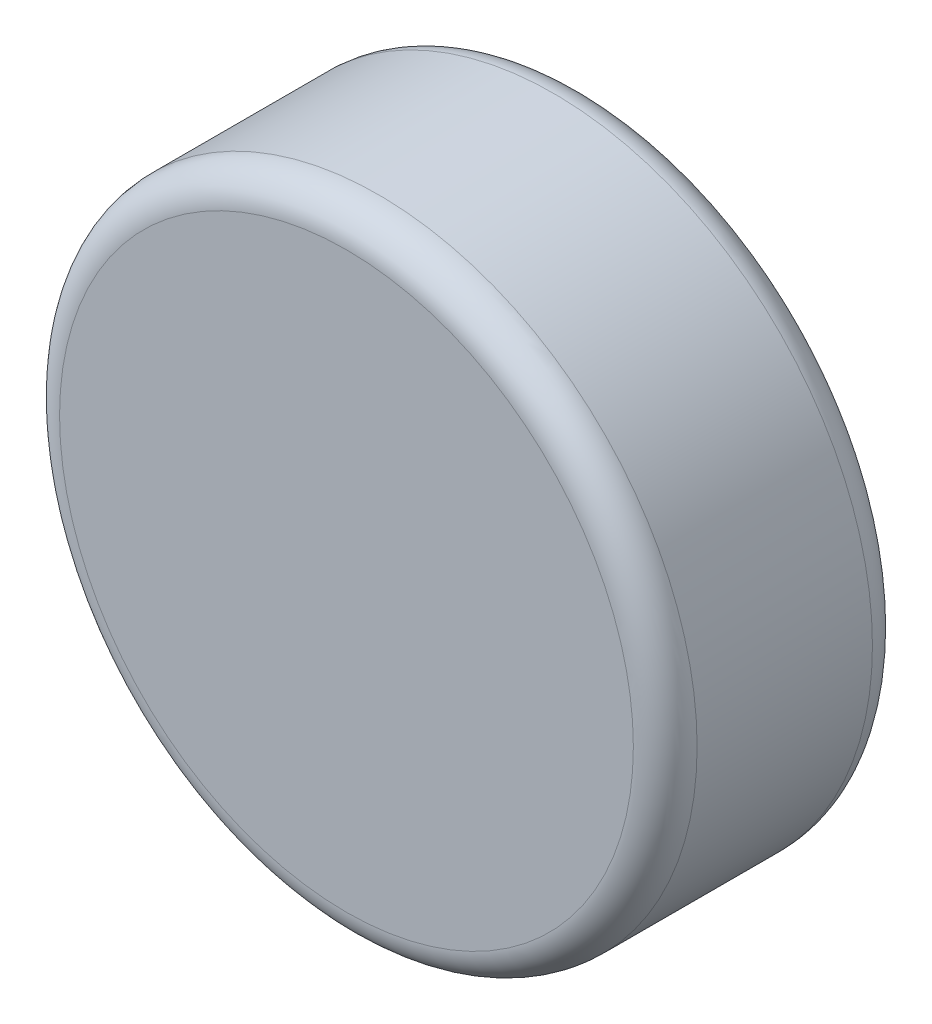
ISO-10303-21;
HEADER;
FILE_DESCRIPTION(('STEP AP214'),'2;1');
FILE_NAME('part.step','',(''),(''),'','','');
FILE_SCHEMA(('AUTOMOTIVE_DESIGN { 1 0 10303 214 1 1 1 1 }'));
ENDSEC;
DATA;
#1=APPLICATION_CONTEXT('core data for automotive mechanical design processes');
#2=APPLICATION_PROTOCOL_DEFINITION('international standard','automotive_design',2000,#1);
#3=PRODUCT_CONTEXT('',#1,'mechanical');
#4=PRODUCT('Part','Part','',(#3));
#5=PRODUCT_RELATED_PRODUCT_CATEGORY('part','',(#4));
#6=PRODUCT_DEFINITION_FORMATION('','',#4);
#7=PRODUCT_DEFINITION_CONTEXT('part definition',#1,'design');
#8=PRODUCT_DEFINITION('design','',#6,#7);
#9=PRODUCT_DEFINITION_SHAPE('','',#8);
#10=(LENGTH_UNIT() NAMED_UNIT(*) SI_UNIT(.MILLI.,.METRE.));
#11=(NAMED_UNIT(*) PLANE_ANGLE_UNIT() SI_UNIT($,.RADIAN.));
#12=(NAMED_UNIT(*) SI_UNIT($,.STERADIAN.) SOLID_ANGLE_UNIT());
#13=UNCERTAINTY_MEASURE_WITH_UNIT(LENGTH_MEASURE(1.E-05),#10,'distance_accuracy_value','');
#14=(GEOMETRIC_REPRESENTATION_CONTEXT(3) GLOBAL_UNCERTAINTY_ASSIGNED_CONTEXT((#13)) GLOBAL_UNIT_ASSIGNED_CONTEXT((#10,
#11,#12)) REPRESENTATION_CONTEXT('',''));
#15=CARTESIAN_POINT('',(0.,0.,0.));
#16=DIRECTION('',(0.,0.,1.));
#17=DIRECTION('',(1.,0.,0.));
#18=AXIS2_PLACEMENT_3D('',#15,#16,#17);
#19=CARTESIAN_POINT('',(0.,0.,30.));
#20=DIRECTION('',(0.,0.,-1.));
#21=DIRECTION('',(-1.,0.,0.));
#22=AXIS2_PLACEMENT_3D('',#19,#20,#21);
#23=CYLINDRICAL_SURFACE('',#22,40.);
#24=CARTESIAN_POINT('',(0.,0.,26.));
#25=DIRECTION('',(0.,0.,1.));
#26=DIRECTION('',(1.,0.,0.));
#27=AXIS2_PLACEMENT_3D('',#24,#25,#26);
#28=CIRCLE('',#27,40.);
#29=CARTESIAN_POINT('',(40.,0.,26.));
#30=VERTEX_POINT('',#29);
#31=EDGE_CURVE('E38',#30,#30,#28,.F.);
#32=ORIENTED_EDGE('',*,*,#31,.T.);
#33=EDGE_LOOP('',(#32));
#34=FACE_BOUND('',#33,.T.);
#35=CARTESIAN_POINT('',(0.,0.,4.));
#36=DIRECTION('',(0.,0.,1.));
#37=DIRECTION('',(1.,0.,0.));
#38=AXIS2_PLACEMENT_3D('',#35,#36,#37);
#39=CIRCLE('',#38,40.);
#40=CARTESIAN_POINT('',(40.,0.,4.));
#41=VERTEX_POINT('',#40);
#42=EDGE_CURVE('E42',#41,#41,#39,.T.);
#43=ORIENTED_EDGE('',*,*,#42,.T.);
#44=EDGE_LOOP('',(#43));
#45=FACE_BOUND('',#44,.T.);
#46=ADVANCED_FACE('F31',(#34,#45),#23,.T.);
#47=CARTESIAN_POINT('',(0.,0.,30.));
#48=DIRECTION('',(0.,0.,1.));
#49=DIRECTION('',(1.,0.,0.));
#50=AXIS2_PLACEMENT_3D('',#47,#48,#49);
#51=PLANE('',#50);
#52=CARTESIAN_POINT('',(0.,0.,30.));
#53=DIRECTION('',(0.,0.,1.));
#54=DIRECTION('',(1.,0.,0.));
#55=AXIS2_PLACEMENT_3D('',#52,#53,#54);
#56=CIRCLE('',#55,36.);
#57=CARTESIAN_POINT('',(36.,0.,30.));
#58=VERTEX_POINT('',#57);
#59=EDGE_CURVE('E46',#58,#58,#56,.T.);
#60=ORIENTED_EDGE('',*,*,#59,.T.);
#61=EDGE_LOOP('',(#60));
#62=FACE_BOUND('',#61,.T.);
#63=ADVANCED_FACE('F52',(#62),#51,.T.);
#64=CARTESIAN_POINT('',(0.,0.,0.));
#65=DIRECTION('',(0.,0.,1.));
#66=DIRECTION('',(1.,0.,0.));
#67=AXIS2_PLACEMENT_3D('',#64,#65,#66);
#68=PLANE('',#67);
#69=CARTESIAN_POINT('',(0.,0.,0.));
#70=DIRECTION('',(0.,0.,1.));
#71=DIRECTION('',(1.,0.,0.));
#72=AXIS2_PLACEMENT_3D('',#69,#70,#71);
#73=CIRCLE('',#72,36.);
#74=CARTESIAN_POINT('',(36.,0.,0.));
#75=VERTEX_POINT('',#74);
#76=EDGE_CURVE('E10',#75,#75,#73,.F.);
#77=ORIENTED_EDGE('',*,*,#76,.T.);
#78=EDGE_LOOP('',(#77));
#79=FACE_BOUND('',#78,.T.);
#80=ADVANCED_FACE('F56',(#79),#68,.F.);
#81=CARTESIAN_POINT('',(0.,0.,26.));
#82=DIRECTION('',(0.,0.,1.));
#83=DIRECTION('',(1.,0.,0.));
#84=AXIS2_PLACEMENT_3D('',#81,#82,#83);
#85=TOROIDAL_SURFACE('',#84,36.,4.);
#86=ORIENTED_EDGE('',*,*,#31,.F.);
#87=EDGE_LOOP('',(#86));
#88=FACE_BOUND('',#87,.T.);
#89=ORIENTED_EDGE('',*,*,#59,.F.);
#90=EDGE_LOOP('',(#89));
#91=FACE_BOUND('',#90,.T.);
#92=ADVANCED_FACE('F54',(#88,#91),#85,.T.);
#93=CARTESIAN_POINT('',(0.,0.,4.));
#94=DIRECTION('',(0.,0.,1.));
#95=DIRECTION('',(1.,0.,0.));
#96=AXIS2_PLACEMENT_3D('',#93,#94,#95);
#97=TOROIDAL_SURFACE('',#96,36.,4.);
#98=ORIENTED_EDGE('',*,*,#76,.F.);
#99=EDGE_LOOP('',(#98));
#100=FACE_BOUND('',#99,.T.);
#101=ORIENTED_EDGE('',*,*,#42,.F.);
#102=EDGE_LOOP('',(#101));
#103=FACE_BOUND('',#102,.T.);
#104=ADVANCED_FACE('F33',(#100,#103),#97,.T.);
#105=CLOSED_SHELL('',(#46,#63,#80,#92,#104));
#106=MANIFOLD_SOLID_BREP('B2',#105);
#107=ADVANCED_BREP_SHAPE_REPRESENTATION('',(#18,#106),#14);
#108=SHAPE_DEFINITION_REPRESENTATION(#9,#107);
ENDSEC;
END-ISO-10303-21;
